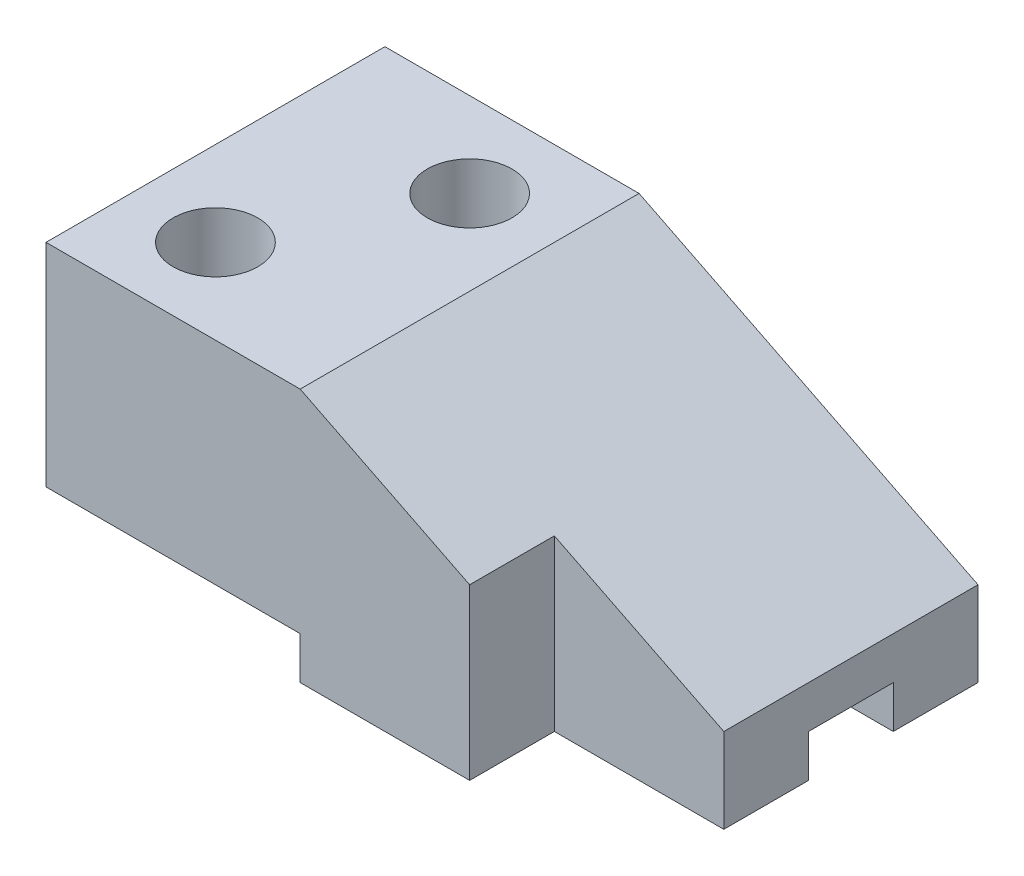
ISO-10303-21;
HEADER;
FILE_DESCRIPTION(('STEP AP214'),'2;1');
FILE_NAME('part.step','',(''),(''),'','','');
FILE_SCHEMA(('AUTOMOTIVE_DESIGN { 1 0 10303 214 1 1 1 1 }'));
ENDSEC;
DATA;
#1=APPLICATION_CONTEXT('core data for automotive mechanical design processes');
#2=APPLICATION_PROTOCOL_DEFINITION('international standard','automotive_design',2000,#1);
#3=PRODUCT_CONTEXT('',#1,'mechanical');
#4=PRODUCT('Part','Part','',(#3));
#5=PRODUCT_RELATED_PRODUCT_CATEGORY('part','',(#4));
#6=PRODUCT_DEFINITION_FORMATION('','',#4);
#7=PRODUCT_DEFINITION_CONTEXT('part definition',#1,'design');
#8=PRODUCT_DEFINITION('design','',#6,#7);
#9=PRODUCT_DEFINITION_SHAPE('','',#8);
#10=(LENGTH_UNIT() NAMED_UNIT(*) SI_UNIT(.MILLI.,.METRE.));
#11=(NAMED_UNIT(*) PLANE_ANGLE_UNIT() SI_UNIT($,.RADIAN.));
#12=(NAMED_UNIT(*) SI_UNIT($,.STERADIAN.) SOLID_ANGLE_UNIT());
#13=UNCERTAINTY_MEASURE_WITH_UNIT(LENGTH_MEASURE(1.E-05),#10,'distance_accuracy_value','');
#14=(GEOMETRIC_REPRESENTATION_CONTEXT(3) GLOBAL_UNCERTAINTY_ASSIGNED_CONTEXT((#13)) GLOBAL_UNIT_ASSIGNED_CONTEXT((#10,
#11,#12)) REPRESENTATION_CONTEXT('',''));
#15=CARTESIAN_POINT('',(0.,0.,0.));
#16=DIRECTION('',(0.,0.,1.));
#17=DIRECTION('',(1.,0.,0.));
#18=AXIS2_PLACEMENT_3D('',#15,#16,#17);
#19=CARTESIAN_POINT('',(0.,0.,0.));
#20=DIRECTION('',(0.,-1.,0.));
#21=DIRECTION('',(0.,0.,-1.));
#22=AXIS2_PLACEMENT_3D('',#19,#20,#21);
#23=PLANE('',#22);
#24=DIRECTION('',(0.,0.,-1.));
#25=VECTOR('',#24,1.);
#26=CARTESIAN_POINT('',(70.,0.,0.));
#27=LINE('',#26,#25);
#28=CARTESIAN_POINT('',(70.,0.,-30.));
#29=VERTEX_POINT('',#28);
#30=CARTESIAN_POINT('',(70.,0.,-40.));
#31=VERTEX_POINT('',#30);
#32=EDGE_CURVE('E252',#29,#31,#27,.T.);
#33=ORIENTED_EDGE('',*,*,#32,.F.);
#34=DIRECTION('',(-1.,0.,0.));
#35=VECTOR('',#34,1.);
#36=CARTESIAN_POINT('',(70.,0.,-30.));
#37=LINE('',#36,#35);
#38=CARTESIAN_POINT('',(30.,0.,-30.));
#39=VERTEX_POINT('',#38);
#40=EDGE_CURVE('E139',#29,#39,#37,.T.);
#41=ORIENTED_EDGE('',*,*,#40,.T.);
#42=DIRECTION('',(0.,0.,1.));
#43=VECTOR('',#42,1.);
#44=CARTESIAN_POINT('',(30.,0.,0.));
#45=LINE('',#44,#43);
#46=CARTESIAN_POINT('',(30.,0.,-40.));
#47=VERTEX_POINT('',#46);
#48=EDGE_CURVE('E194',#47,#39,#45,.T.);
#49=ORIENTED_EDGE('',*,*,#48,.F.);
#50=DIRECTION('',(-1.,0.,0.));
#51=VECTOR('',#50,1.);
#52=CARTESIAN_POINT('',(0.,0.,-40.));
#53=LINE('',#52,#51);
#54=EDGE_CURVE('E242',#31,#47,#53,.T.);
#55=ORIENTED_EDGE('',*,*,#54,.F.);
#56=EDGE_LOOP('',(#33,#41,#49,#55));
#57=FACE_BOUND('',#56,.T.);
#58=ADVANCED_FACE('F39',(#57),#23,.T.);
#59=CARTESIAN_POINT('',(30.,0.,0.));
#60=DIRECTION('',(-1.,0.,0.));
#61=DIRECTION('',(0.,0.,1.));
#62=AXIS2_PLACEMENT_3D('',#59,#60,#61);
#63=PLANE('',#62);
#64=ORIENTED_EDGE('',*,*,#48,.T.);
#65=DIRECTION('',(0.,1.,0.));
#66=VECTOR('',#65,1.);
#67=CARTESIAN_POINT('',(30.,0.,-30.));
#68=LINE('',#67,#66);
#69=CARTESIAN_POINT('',(30.,5.,-30.));
#70=VERTEX_POINT('',#69);
#71=EDGE_CURVE('E163',#39,#70,#68,.T.);
#72=ORIENTED_EDGE('',*,*,#71,.T.);
#73=DIRECTION('',(0.,0.,-1.));
#74=VECTOR('',#73,1.);
#75=CARTESIAN_POINT('',(30.,5.,0.));
#76=LINE('',#75,#74);
#77=CARTESIAN_POINT('',(30.,4.99999999999999,-40.));
#78=VERTEX_POINT('',#77);
#79=EDGE_CURVE('E153',#70,#78,#76,.T.);
#80=ORIENTED_EDGE('',*,*,#79,.T.);
#81=DIRECTION('',(0.,-1.,0.));
#82=VECTOR('',#81,1.);
#83=CARTESIAN_POINT('',(30.,0.,-40.));
#84=LINE('',#83,#82);
#85=EDGE_CURVE('E65',#78,#47,#84,.T.);
#86=ORIENTED_EDGE('',*,*,#85,.T.);
#87=EDGE_LOOP('',(#64,#72,#80,#86));
#88=FACE_BOUND('',#87,.T.);
#89=ADVANCED_FACE('F320',(#88),#63,.T.);
#90=DIRECTION('',(-1.,0.,0.));
#91=VECTOR('',#90,1.);
#92=CARTESIAN_POINT('',(70.,0.,-20.));
#93=LINE('',#92,#91);
#94=CARTESIAN_POINT('',(70.,0.,-20.));
#95=VERTEX_POINT('',#94);
#96=CARTESIAN_POINT('',(30.,0.,-20.));
#97=VERTEX_POINT('',#96);
#98=EDGE_CURVE('E178',#95,#97,#93,.T.);
#99=ORIENTED_EDGE('',*,*,#98,.F.);
#100=CARTESIAN_POINT('',(70.,0.,-10.));
#101=VERTEX_POINT('',#100);
#102=EDGE_CURVE('E253',#101,#95,#27,.T.);
#103=ORIENTED_EDGE('',*,*,#102,.F.);
#104=DIRECTION('',(1.,0.,0.));
#105=VECTOR('',#104,1.);
#106=CARTESIAN_POINT('',(70.,0.,-10.));
#107=LINE('',#106,#105);
#108=CARTESIAN_POINT('',(50.,0.,-10.));
#109=VERTEX_POINT('',#108);
#110=EDGE_CURVE('E210',#109,#101,#107,.T.);
#111=ORIENTED_EDGE('',*,*,#110,.F.);
#112=DIRECTION('',(0.,0.,-1.));
#113=VECTOR('',#112,1.);
#114=CARTESIAN_POINT('',(50.,0.,0.));
#115=LINE('',#114,#113);
#116=CARTESIAN_POINT('',(50.,0.,0.));
#117=VERTEX_POINT('',#116);
#118=EDGE_CURVE('E204',#117,#109,#115,.T.);
#119=ORIENTED_EDGE('',*,*,#118,.F.);
#120=DIRECTION('',(1.,0.,0.));
#121=VECTOR('',#120,1.);
#122=CARTESIAN_POINT('',(0.,0.,0.));
#123=LINE('',#122,#121);
#124=CARTESIAN_POINT('',(30.,0.,0.));
#125=VERTEX_POINT('',#124);
#126=EDGE_CURVE('E236',#125,#117,#123,.T.);
#127=ORIENTED_EDGE('',*,*,#126,.F.);
#128=EDGE_CURVE('E193',#97,#125,#45,.T.);
#129=ORIENTED_EDGE('',*,*,#128,.F.);
#130=EDGE_LOOP('',(#99,#103,#111,#119,#127,#129));
#131=FACE_BOUND('',#130,.T.);
#132=ADVANCED_FACE('F324',(#131),#23,.T.);
#133=CARTESIAN_POINT('',(0.,30.,0.));
#134=DIRECTION('',(1.,0.,0.));
#135=DIRECTION('',(0.,0.,-1.));
#136=AXIS2_PLACEMENT_3D('',#133,#134,#135);
#137=PLANE('',#136);
#138=DIRECTION('',(0.,-1.,0.));
#139=VECTOR('',#138,1.);
#140=CARTESIAN_POINT('',(0.,30.,-40.));
#141=LINE('',#140,#139);
#142=CARTESIAN_POINT('',(0.,30.,-40.));
#143=VERTEX_POINT('',#142);
#144=CARTESIAN_POINT('',(0.,4.99999999999999,-40.));
#145=VERTEX_POINT('',#144);
#146=EDGE_CURVE('E249',#143,#145,#141,.T.);
#147=ORIENTED_EDGE('',*,*,#146,.T.);
#148=DIRECTION('',(0.,0.,-1.));
#149=VECTOR('',#148,1.);
#150=CARTESIAN_POINT('',(0.,5.,0.));
#151=LINE('',#150,#149);
#152=CARTESIAN_POINT('',(0.,5.,0.));
#153=VERTEX_POINT('',#152);
#154=EDGE_CURVE('E177',#153,#145,#151,.T.);
#155=ORIENTED_EDGE('',*,*,#154,.F.);
#156=DIRECTION('',(0.,-1.,0.));
#157=VECTOR('',#156,1.);
#158=CARTESIAN_POINT('',(0.,30.,0.));
#159=LINE('',#158,#157);
#160=CARTESIAN_POINT('',(0.,30.,0.));
#161=VERTEX_POINT('',#160);
#162=EDGE_CURVE('E266',#161,#153,#159,.T.);
#163=ORIENTED_EDGE('',*,*,#162,.F.);
#164=DIRECTION('',(0.,0.,1.));
#165=VECTOR('',#164,1.);
#166=CARTESIAN_POINT('',(0.,30.,0.));
#167=LINE('',#166,#165);
#168=EDGE_CURVE('E237',#143,#161,#167,.T.);
#169=ORIENTED_EDGE('',*,*,#168,.F.);
#170=EDGE_LOOP('',(#147,#155,#163,#169));
#171=FACE_BOUND('',#170,.T.);
#172=ADVANCED_FACE('F41',(#171),#137,.F.);
#173=CARTESIAN_POINT('',(0.,30.,0.));
#174=DIRECTION('',(0.,0.,-1.));
#175=DIRECTION('',(-1.,0.,0.));
#176=AXIS2_PLACEMENT_3D('',#173,#174,#175);
#177=PLANE('',#176);
#178=ORIENTED_EDGE('',*,*,#162,.T.);
#179=DIRECTION('',(-1.,0.,0.));
#180=VECTOR('',#179,1.);
#181=CARTESIAN_POINT('',(30.,5.,0.));
#182=LINE('',#181,#180);
#183=CARTESIAN_POINT('',(30.,5.,0.));
#184=VERTEX_POINT('',#183);
#185=EDGE_CURVE('E197',#184,#153,#182,.T.);
#186=ORIENTED_EDGE('',*,*,#185,.F.);
#187=DIRECTION('',(0.,1.,0.));
#188=VECTOR('',#187,1.);
#189=CARTESIAN_POINT('',(30.,0.,0.));
#190=LINE('',#189,#188);
#191=EDGE_CURVE('E183',#125,#184,#190,.T.);
#192=ORIENTED_EDGE('',*,*,#191,.F.);
#193=ORIENTED_EDGE('',*,*,#126,.T.);
#194=DIRECTION('',(0.,-1.,0.));
#195=VECTOR('',#194,1.);
#196=CARTESIAN_POINT('',(50.,49.,0.));
#197=LINE('',#196,#195);
#198=CARTESIAN_POINT('',(50.,20.,0.));
#199=VERTEX_POINT('',#198);
#200=EDGE_CURVE('E213',#199,#117,#197,.T.);
#201=ORIENTED_EDGE('',*,*,#200,.F.);
#202=DIRECTION('',(0.894427190999916,-0.447213595499958,0.));
#203=VECTOR('',#202,1.);
#204=CARTESIAN_POINT('',(30.,30.,0.));
#205=LINE('',#204,#203);
#206=CARTESIAN_POINT('',(30.,30.,0.));
#207=VERTEX_POINT('',#206);
#208=EDGE_CURVE('E218',#207,#199,#205,.T.);
#209=ORIENTED_EDGE('',*,*,#208,.F.);
#210=DIRECTION('',(1.,0.,0.));
#211=VECTOR('',#210,1.);
#212=CARTESIAN_POINT('',(0.,30.,0.));
#213=LINE('',#212,#211);
#214=EDGE_CURVE('E241',#161,#207,#213,.T.);
#215=ORIENTED_EDGE('',*,*,#214,.F.);
#216=EDGE_LOOP('',(#178,#186,#192,#193,#201,#209,#215));
#217=FACE_BOUND('',#216,.T.);
#218=ADVANCED_FACE('F308',(#217),#177,.F.);
#219=CARTESIAN_POINT('',(70.,30.,0.));
#220=DIRECTION('',(-1.,0.,0.));
#221=DIRECTION('',(0.,0.,1.));
#222=AXIS2_PLACEMENT_3D('',#219,#220,#221);
#223=PLANE('',#222);
#224=ORIENTED_EDGE('',*,*,#102,.T.);
#225=DIRECTION('',(0.,1.,0.));
#226=VECTOR('',#225,1.);
#227=CARTESIAN_POINT('',(70.,0.,-20.));
#228=LINE('',#227,#226);
#229=CARTESIAN_POINT('',(70.,5.,-20.));
#230=VERTEX_POINT('',#229);
#231=EDGE_CURVE('E144',#95,#230,#228,.T.);
#232=ORIENTED_EDGE('',*,*,#231,.T.);
#233=DIRECTION('',(0.,0.,-1.));
#234=VECTOR('',#233,1.);
#235=CARTESIAN_POINT('',(70.,5.,-20.));
#236=LINE('',#235,#234);
#237=CARTESIAN_POINT('',(70.,5.,-30.));
#238=VERTEX_POINT('',#237);
#239=EDGE_CURVE('E145',#230,#238,#236,.T.);
#240=ORIENTED_EDGE('',*,*,#239,.T.);
#241=DIRECTION('',(0.,1.,0.));
#242=VECTOR('',#241,1.);
#243=CARTESIAN_POINT('',(70.,0.,-30.));
#244=LINE('',#243,#242);
#245=EDGE_CURVE('E136',#29,#238,#244,.T.);
#246=ORIENTED_EDGE('',*,*,#245,.F.);
#247=ORIENTED_EDGE('',*,*,#32,.T.);
#248=DIRECTION('',(0.,-1.,0.));
#249=VECTOR('',#248,1.);
#250=CARTESIAN_POINT('',(70.,30.,-40.));
#251=LINE('',#250,#249);
#252=CARTESIAN_POINT('',(70.,10.,-40.));
#253=VERTEX_POINT('',#252);
#254=EDGE_CURVE('E262',#253,#31,#251,.T.);
#255=ORIENTED_EDGE('',*,*,#254,.F.);
#256=DIRECTION('',(0.,0.,1.));
#257=VECTOR('',#256,1.);
#258=CARTESIAN_POINT('',(70.,10.,-49.));
#259=LINE('',#258,#257);
#260=CARTESIAN_POINT('',(70.,10.,-10.));
#261=VERTEX_POINT('',#260);
#262=EDGE_CURVE('E228',#253,#261,#259,.T.);
#263=ORIENTED_EDGE('',*,*,#262,.T.);
#264=DIRECTION('',(0.,-1.,0.));
#265=VECTOR('',#264,1.);
#266=CARTESIAN_POINT('',(70.,49.,-10.));
#267=LINE('',#266,#265);
#268=EDGE_CURVE('E214',#261,#101,#267,.T.);
#269=ORIENTED_EDGE('',*,*,#268,.T.);
#270=EDGE_LOOP('',(#224,#232,#240,#246,#247,#255,#263,#269));
#271=FACE_BOUND('',#270,.T.);
#272=ADVANCED_FACE('F157',(#271),#223,.F.);
#273=CARTESIAN_POINT('',(0.,30.,-40.));
#274=DIRECTION('',(0.,0.,1.));
#275=DIRECTION('',(1.,0.,0.));
#276=AXIS2_PLACEMENT_3D('',#273,#274,#275);
#277=PLANE('',#276);
#278=ORIENTED_EDGE('',*,*,#85,.F.);
#279=DIRECTION('',(-1.,0.,0.));
#280=VECTOR('',#279,1.);
#281=CARTESIAN_POINT('',(30.,4.99999999999999,-40.));
#282=LINE('',#281,#280);
#283=EDGE_CURVE('E200',#78,#145,#282,.T.);
#284=ORIENTED_EDGE('',*,*,#283,.T.);
#285=ORIENTED_EDGE('',*,*,#146,.F.);
#286=DIRECTION('',(-1.,0.,0.));
#287=VECTOR('',#286,1.);
#288=CARTESIAN_POINT('',(0.,30.,-40.));
#289=LINE('',#288,#287);
#290=CARTESIAN_POINT('',(30.,30.,-40.));
#291=VERTEX_POINT('',#290);
#292=EDGE_CURVE('E246',#291,#143,#289,.T.);
#293=ORIENTED_EDGE('',*,*,#292,.F.);
#294=DIRECTION('',(0.894427190999916,-0.447213595499958,0.));
#295=VECTOR('',#294,1.);
#296=CARTESIAN_POINT('',(5.99999999999998,42.,-40.));
#297=LINE('',#296,#295);
#298=EDGE_CURVE('E232',#291,#253,#297,.T.);
#299=ORIENTED_EDGE('',*,*,#298,.T.);
#300=ORIENTED_EDGE('',*,*,#254,.T.);
#301=ORIENTED_EDGE('',*,*,#54,.T.);
#302=EDGE_LOOP('',(#278,#284,#285,#293,#299,#300,#301));
#303=FACE_BOUND('',#302,.T.);
#304=ADVANCED_FACE('F300',(#303),#277,.F.);
#305=CARTESIAN_POINT('',(0.,30.,0.));
#306=DIRECTION('',(0.,-1.,0.));
#307=DIRECTION('',(0.,0.,-1.));
#308=AXIS2_PLACEMENT_3D('',#305,#306,#307);
#309=PLANE('',#308);
#310=CARTESIAN_POINT('',(20.,30.,-30.));
#311=DIRECTION('',(0.,1.,0.));
#312=DIRECTION('',(0.,0.,1.));
#313=AXIS2_PLACEMENT_3D('',#310,#311,#312);
#314=CIRCLE('',#313,5.);
#315=CARTESIAN_POINT('',(20.,30.,-25.));
#316=VERTEX_POINT('',#315);
#317=EDGE_CURVE('E286',#316,#316,#314,.T.);
#318=ORIENTED_EDGE('',*,*,#317,.F.);
#319=EDGE_LOOP('',(#318));
#320=FACE_BOUND('',#319,.T.);
#321=CARTESIAN_POINT('',(10.,30.,-10.));
#322=DIRECTION('',(0.,1.,0.));
#323=DIRECTION('',(0.,0.,1.));
#324=AXIS2_PLACEMENT_3D('',#321,#322,#323);
#325=CIRCLE('',#324,5.);
#326=CARTESIAN_POINT('',(10.,30.,-5.));
#327=VERTEX_POINT('',#326);
#328=EDGE_CURVE('E166',#327,#327,#325,.T.);
#329=ORIENTED_EDGE('',*,*,#328,.F.);
#330=EDGE_LOOP('',(#329));
#331=FACE_BOUND('',#330,.T.);
#332=ORIENTED_EDGE('',*,*,#214,.T.);
#333=DIRECTION('',(0.,0.,-1.));
#334=VECTOR('',#333,1.);
#335=CARTESIAN_POINT('',(30.,30.,0.));
#336=LINE('',#335,#334);
#337=EDGE_CURVE('E270',#207,#291,#336,.T.);
#338=ORIENTED_EDGE('',*,*,#337,.T.);
#339=ORIENTED_EDGE('',*,*,#292,.T.);
#340=ORIENTED_EDGE('',*,*,#168,.T.);
#341=EDGE_LOOP('',(#332,#338,#339,#340));
#342=FACE_BOUND('',#341,.T.);
#343=ADVANCED_FACE('F296',(#320,#331,#342),#309,.F.);
#344=CARTESIAN_POINT('',(30.,30.,-49.));
#345=DIRECTION('',(-0.447213595499958,-0.894427190999916,0.));
#346=DIRECTION('',(0.894427190999916,-0.447213595499958,0.));
#347=AXIS2_PLACEMENT_3D('',#344,#345,#346);
#348=PLANE('',#347);
#349=DIRECTION('',(0.,0.,-1.));
#350=VECTOR('',#349,1.);
#351=CARTESIAN_POINT('',(50.,20.,-49.));
#352=LINE('',#351,#350);
#353=CARTESIAN_POINT('',(50.,20.,-9.99999999999999));
#354=VERTEX_POINT('',#353);
#355=EDGE_CURVE('E49',#199,#354,#352,.T.);
#356=ORIENTED_EDGE('',*,*,#355,.T.);
#357=DIRECTION('',(0.894427190999916,-0.447213595499958,0.));
#358=VECTOR('',#357,1.);
#359=CARTESIAN_POINT('',(30.,30.,-10.));
#360=LINE('',#359,#358);
#361=EDGE_CURVE('E11',#354,#261,#360,.T.);
#362=ORIENTED_EDGE('',*,*,#361,.T.);
#363=ORIENTED_EDGE('',*,*,#262,.F.);
#364=ORIENTED_EDGE('',*,*,#298,.F.);
#365=ORIENTED_EDGE('',*,*,#337,.F.);
#366=ORIENTED_EDGE('',*,*,#208,.T.);
#367=EDGE_LOOP('',(#356,#362,#363,#364,#365,#366));
#368=FACE_BOUND('',#367,.T.);
#369=ADVANCED_FACE('F299',(#368),#348,.F.);
#370=CARTESIAN_POINT('',(70.,49.,-10.));
#371=DIRECTION('',(0.,0.,-1.));
#372=DIRECTION('',(-1.,0.,0.));
#373=AXIS2_PLACEMENT_3D('',#370,#371,#372);
#374=PLANE('',#373);
#375=DIRECTION('',(0.,-1.,0.));
#376=VECTOR('',#375,1.);
#377=CARTESIAN_POINT('',(50.,49.,-10.));
#378=LINE('',#377,#376);
#379=EDGE_CURVE('E219',#354,#109,#378,.T.);
#380=ORIENTED_EDGE('',*,*,#379,.T.);
#381=ORIENTED_EDGE('',*,*,#110,.T.);
#382=ORIENTED_EDGE('',*,*,#268,.F.);
#383=ORIENTED_EDGE('',*,*,#361,.F.);
#384=EDGE_LOOP('',(#380,#381,#382,#383));
#385=FACE_BOUND('',#384,.T.);
#386=ADVANCED_FACE('F346',(#385),#374,.F.);
#387=CARTESIAN_POINT('',(50.,49.,0.));
#388=DIRECTION('',(-1.,0.,0.));
#389=DIRECTION('',(0.,0.,1.));
#390=AXIS2_PLACEMENT_3D('',#387,#388,#389);
#391=PLANE('',#390);
#392=ORIENTED_EDGE('',*,*,#200,.T.);
#393=ORIENTED_EDGE('',*,*,#118,.T.);
#394=ORIENTED_EDGE('',*,*,#379,.F.);
#395=ORIENTED_EDGE('',*,*,#355,.F.);
#396=EDGE_LOOP('',(#392,#393,#394,#395));
#397=FACE_BOUND('',#396,.T.);
#398=ADVANCED_FACE('F349',(#397),#391,.F.);
#399=CARTESIAN_POINT('',(30.,5.,0.));
#400=DIRECTION('',(0.,1.,0.));
#401=DIRECTION('',(0.,0.,1.));
#402=AXIS2_PLACEMENT_3D('',#399,#400,#401);
#403=PLANE('',#402);
#404=CARTESIAN_POINT('',(20.,5.,-30.));
#405=DIRECTION('',(0.,1.,0.));
#406=DIRECTION('',(0.,0.,1.));
#407=AXIS2_PLACEMENT_3D('',#404,#405,#406);
#408=CIRCLE('',#407,5.);
#409=CARTESIAN_POINT('',(20.,5.,-25.));
#410=VERTEX_POINT('',#409);
#411=EDGE_CURVE('E43',#410,#410,#408,.T.);
#412=ORIENTED_EDGE('',*,*,#411,.T.);
#413=EDGE_LOOP('',(#412));
#414=FACE_BOUND('',#413,.T.);
#415=CARTESIAN_POINT('',(10.,5.,-10.));
#416=DIRECTION('',(0.,1.,0.));
#417=DIRECTION('',(0.,0.,1.));
#418=AXIS2_PLACEMENT_3D('',#415,#416,#417);
#419=CIRCLE('',#418,5.);
#420=CARTESIAN_POINT('',(10.,5.,-5.));
#421=VERTEX_POINT('',#420);
#422=EDGE_CURVE('E172',#421,#421,#419,.T.);
#423=ORIENTED_EDGE('',*,*,#422,.T.);
#424=EDGE_LOOP('',(#423));
#425=FACE_BOUND('',#424,.T.);
#426=ORIENTED_EDGE('',*,*,#154,.T.);
#427=ORIENTED_EDGE('',*,*,#283,.F.);
#428=ORIENTED_EDGE('',*,*,#79,.F.);
#429=DIRECTION('',(-1.,0.,0.));
#430=VECTOR('',#429,1.);
#431=CARTESIAN_POINT('',(70.,5.,-30.));
#432=LINE('',#431,#430);
#433=EDGE_CURVE('E57',#238,#70,#432,.T.);
#434=ORIENTED_EDGE('',*,*,#433,.F.);
#435=ORIENTED_EDGE('',*,*,#239,.F.);
#436=DIRECTION('',(-1.,0.,0.));
#437=VECTOR('',#436,1.);
#438=CARTESIAN_POINT('',(70.,5.,-20.));
#439=LINE('',#438,#437);
#440=CARTESIAN_POINT('',(30.,5.,-20.));
#441=VERTEX_POINT('',#440);
#442=EDGE_CURVE('E174',#230,#441,#439,.T.);
#443=ORIENTED_EDGE('',*,*,#442,.T.);
#444=EDGE_CURVE('E187',#184,#441,#76,.T.);
#445=ORIENTED_EDGE('',*,*,#444,.F.);
#446=ORIENTED_EDGE('',*,*,#185,.T.);
#447=EDGE_LOOP('',(#426,#427,#428,#434,#435,#443,#445,#446));
#448=FACE_BOUND('',#447,.T.);
#449=ADVANCED_FACE('F150',(#414,#425,#448),#403,.F.);
#450=DIRECTION('',(0.,1.,0.));
#451=VECTOR('',#450,1.);
#452=CARTESIAN_POINT('',(30.,0.,-20.));
#453=LINE('',#452,#451);
#454=EDGE_CURVE('E159',#97,#441,#453,.T.);
#455=ORIENTED_EDGE('',*,*,#454,.F.);
#456=ORIENTED_EDGE('',*,*,#128,.T.);
#457=ORIENTED_EDGE('',*,*,#191,.T.);
#458=ORIENTED_EDGE('',*,*,#444,.T.);
#459=EDGE_LOOP('',(#455,#456,#457,#458));
#460=FACE_BOUND('',#459,.T.);
#461=ADVANCED_FACE('F329',(#460),#63,.T.);
#462=CARTESIAN_POINT('',(70.,0.,-20.));
#463=DIRECTION('',(0.,0.,1.));
#464=DIRECTION('',(1.,0.,0.));
#465=AXIS2_PLACEMENT_3D('',#462,#463,#464);
#466=PLANE('',#465);
#467=ORIENTED_EDGE('',*,*,#454,.T.);
#468=ORIENTED_EDGE('',*,*,#442,.F.);
#469=ORIENTED_EDGE('',*,*,#231,.F.);
#470=ORIENTED_EDGE('',*,*,#98,.T.);
#471=EDGE_LOOP('',(#467,#468,#469,#470));
#472=FACE_BOUND('',#471,.T.);
#473=ADVANCED_FACE('F426',(#472),#466,.F.);
#474=CARTESIAN_POINT('',(70.,0.,-30.));
#475=DIRECTION('',(0.,0.,1.));
#476=DIRECTION('',(1.,0.,0.));
#477=AXIS2_PLACEMENT_3D('',#474,#475,#476);
#478=PLANE('',#477);
#479=ORIENTED_EDGE('',*,*,#71,.F.);
#480=ORIENTED_EDGE('',*,*,#40,.F.);
#481=ORIENTED_EDGE('',*,*,#245,.T.);
#482=ORIENTED_EDGE('',*,*,#433,.T.);
#483=EDGE_LOOP('',(#479,#480,#481,#482));
#484=FACE_BOUND('',#483,.T.);
#485=ADVANCED_FACE('F137',(#484),#478,.T.);
#486=CARTESIAN_POINT('',(10.,0.,-10.));
#487=DIRECTION('',(0.,1.,0.));
#488=DIRECTION('',(0.,0.,1.));
#489=AXIS2_PLACEMENT_3D('',#486,#487,#488);
#490=CYLINDRICAL_SURFACE('',#489,5.);
#491=ORIENTED_EDGE('',*,*,#328,.T.);
#492=EDGE_LOOP('',(#491));
#493=FACE_BOUND('',#492,.T.);
#494=ORIENTED_EDGE('',*,*,#422,.F.);
#495=EDGE_LOOP('',(#494));
#496=FACE_BOUND('',#495,.T.);
#497=ADVANCED_FACE('F443',(#493,#496),#490,.F.);
#498=CARTESIAN_POINT('',(20.,0.,-30.));
#499=DIRECTION('',(0.,1.,0.));
#500=DIRECTION('',(0.,0.,1.));
#501=AXIS2_PLACEMENT_3D('',#498,#499,#500);
#502=CYLINDRICAL_SURFACE('',#501,5.);
#503=ORIENTED_EDGE('',*,*,#317,.T.);
#504=EDGE_LOOP('',(#503));
#505=FACE_BOUND('',#504,.T.);
#506=ORIENTED_EDGE('',*,*,#411,.F.);
#507=EDGE_LOOP('',(#506));
#508=FACE_BOUND('',#507,.T.);
#509=ADVANCED_FACE('F293',(#505,#508),#502,.F.);
#510=CLOSED_SHELL('',(#58,#89,#132,#172,#218,#272,#304,#343,#369,#386,#398,#449,#461,#473,#485,
#497,#509));
#511=MANIFOLD_SOLID_BREP('B2',#510);
#512=ADVANCED_BREP_SHAPE_REPRESENTATION('',(#18,#511),#14);
#513=SHAPE_DEFINITION_REPRESENTATION(#9,#512);
ENDSEC;
END-ISO-10303-21;
